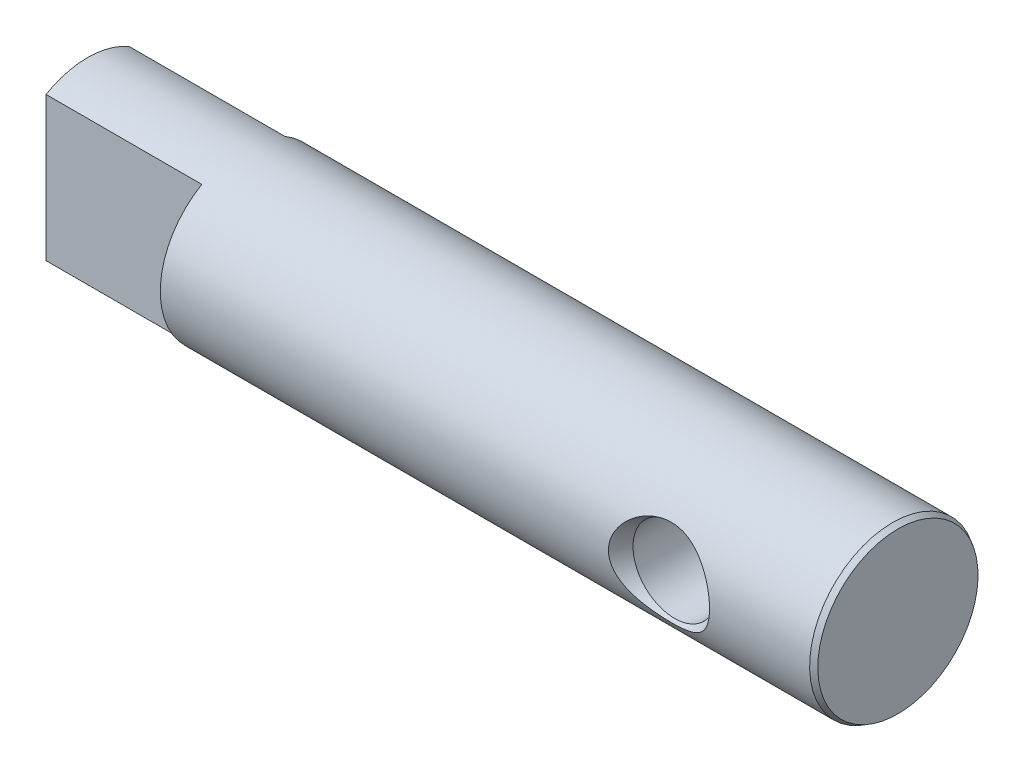
ISO-10303-21;
HEADER;
FILE_DESCRIPTION(('STEP AP214'),'2;1');
FILE_NAME('part.step','',(''),(''),'','','');
FILE_SCHEMA(('AUTOMOTIVE_DESIGN { 1 0 10303 214 1 1 1 1 }'));
ENDSEC;
DATA;
#1=APPLICATION_CONTEXT('core data for automotive mechanical design processes');
#2=APPLICATION_PROTOCOL_DEFINITION('international standard','automotive_design',2000,#1);
#3=PRODUCT_CONTEXT('',#1,'mechanical');
#4=PRODUCT('Part','Part','',(#3));
#5=PRODUCT_RELATED_PRODUCT_CATEGORY('part','',(#4));
#6=PRODUCT_DEFINITION_FORMATION('','',#4);
#7=PRODUCT_DEFINITION_CONTEXT('part definition',#1,'design');
#8=PRODUCT_DEFINITION('design','',#6,#7);
#9=PRODUCT_DEFINITION_SHAPE('','',#8);
#10=(LENGTH_UNIT() NAMED_UNIT(*) SI_UNIT(.MILLI.,.METRE.));
#11=(NAMED_UNIT(*) PLANE_ANGLE_UNIT() SI_UNIT($,.RADIAN.));
#12=(NAMED_UNIT(*) SI_UNIT($,.STERADIAN.) SOLID_ANGLE_UNIT());
#13=UNCERTAINTY_MEASURE_WITH_UNIT(LENGTH_MEASURE(1.E-05),#10,'distance_accuracy_value','');
#14=(GEOMETRIC_REPRESENTATION_CONTEXT(3) GLOBAL_UNCERTAINTY_ASSIGNED_CONTEXT((#13)) GLOBAL_UNIT_ASSIGNED_CONTEXT((#10,
#11,#12)) REPRESENTATION_CONTEXT('',''));
#15=CARTESIAN_POINT('',(0.,0.,0.));
#16=DIRECTION('',(0.,0.,1.));
#17=DIRECTION('',(1.,0.,0.));
#18=AXIS2_PLACEMENT_3D('',#15,#16,#17);
#19=CARTESIAN_POINT('',(15.,0.,0.));
#20=DIRECTION('',(1.,0.,0.));
#21=DIRECTION('',(0.,1.,0.));
#22=AXIS2_PLACEMENT_3D('',#19,#20,#21);
#23=CYLINDRICAL_SURFACE('',#22,8.);
#24=CARTESIAN_POINT('',(14.5,0.,0.));
#25=DIRECTION('',(1.,0.,0.));
#26=DIRECTION('',(0.,1.,0.));
#27=AXIS2_PLACEMENT_3D('',#24,#25,#26);
#28=CIRCLE('',#27,8.);
#29=CARTESIAN_POINT('',(14.5,8.,0.));
#30=VERTEX_POINT('',#29);
#31=EDGE_CURVE('E122',#30,#30,#28,.T.);
#32=ORIENTED_EDGE('',*,*,#31,.F.);
#33=EDGE_LOOP('',(#32));
#34=FACE_BOUND('',#33,.T.);
#35=CARTESIAN_POINT('',(-3.23683477862762,-3.12486114398773,-7.36445813134765));
#36=CARTESIAN_POINT('',(-3.04194482102559,-3.27409805570671,-7.30113503807417));
#37=CARTESIAN_POINT('',(-2.8351582818973,-3.40827516316058,-7.23886070557551));
#38=CARTESIAN_POINT('',(-2.40227006066119,-3.64578895202264,-7.12220400228846));
#39=CARTESIAN_POINT('',(-2.17615357990684,-3.74910172733321,-7.06782776566555));
#40=CARTESIAN_POINT('',(-1.8093683222357,-3.88632504679503,-6.9928308120319));
#41=CARTESIAN_POINT('',(-1.67354086803081,-3.9310159033196,-6.96772264500047));
#42=CARTESIAN_POINT('',(-1.3980024296328,-4.00973394904154,-6.92272341623511));
#43=CARTESIAN_POINT('',(-1.2582927521902,-4.04376468019901,-6.90283062198726));
#44=CARTESIAN_POINT('',(-0.975989373587526,-4.1009569763707,-6.86900691469607));
#45=CARTESIAN_POINT('',(-0.833396289113142,-4.12412084040686,-6.85507474066378));
#46=CARTESIAN_POINT('',(-0.546371553215897,-4.15942436549178,-6.83371186825516));
#47=CARTESIAN_POINT('',(-0.401940028075111,-4.17156477963922,-6.82628072574342));
#48=CARTESIAN_POINT('',(-0.11737636637319,-4.18449820507676,-6.81835967203449));
#49=CARTESIAN_POINT('',(0.0227323773659287,-4.18566790283176,-6.81763934662852));
#50=CARTESIAN_POINT('',(0.302538211509929,-4.17763213055545,-6.82256639061613));
#51=CARTESIAN_POINT('',(0.442235307127359,-4.16842679247037,-6.82821367902853));
#52=CARTESIAN_POINT('',(0.720181380135249,-4.13971054275887,-6.84566119310642));
#53=CARTESIAN_POINT('',(0.858430287005049,-4.12019913162761,-6.85746171700065));
#54=CARTESIAN_POINT('',(1.13248544326332,-4.07100815023276,-6.88677792246891));
#55=CARTESIAN_POINT('',(1.26829167404808,-4.04132850256114,-6.90429364755117));
#56=CARTESIAN_POINT('',(1.53380980792103,-3.97268572731665,-6.94401226579535));
#57=CARTESIAN_POINT('',(1.66358956475488,-3.93392523677235,-6.96611178679297));
#58=CARTESIAN_POINT('',(1.91917360136902,-3.84699715379752,-7.01449073055792));
#59=CARTESIAN_POINT('',(2.04497642400082,-3.79882615872705,-7.04077166459627));
#60=CARTESIAN_POINT('',(2.41543641148982,-3.64038084621409,-7.12474372442281));
#61=CARTESIAN_POINT('',(2.6531645010099,-3.51616919693082,-7.187567199659));
#62=CARTESIAN_POINT('',(3.11693331884269,-3.22376849079439,-7.3235775171216));
#63=CARTESIAN_POINT('',(3.34152894849119,-3.05347126626387,-7.39715149529301));
#64=CARTESIAN_POINT('',(3.75565806193333,-2.67392533395375,-7.54262523666468));
#65=CARTESIAN_POINT('',(3.94524483239767,-2.46473681276248,-7.61452739623738));
#66=CARTESIAN_POINT('',(4.23546879597314,-2.07020129349562,-7.72946817167445));
#67=CARTESIAN_POINT('',(4.34637538673362,-1.89313858079832,-7.77511559159303));
#68=CARTESIAN_POINT('',(4.53930585634451,-1.52157417839834,-7.85625469888758));
#69=CARTESIAN_POINT('',(4.62135480490873,-1.32708781052204,-7.89175519622646));
#70=CARTESIAN_POINT('',(4.71945944505806,-1.02509569463906,-7.93471574001735));
#71=CARTESIAN_POINT('',(4.7480673167741,-0.922260713203622,-7.94735243354183));
#72=CARTESIAN_POINT('',(4.79628013133841,-0.714124740015657,-7.96874767536054));
#73=CARTESIAN_POINT('',(4.81588949721979,-0.60882498658076,-7.97750812886604));
#74=CARTESIAN_POINT('',(4.84572253122964,-0.396663671065642,-7.9908666349737));
#75=CARTESIAN_POINT('',(4.85594853413815,-0.289802504224912,-7.99546572300802));
#76=CARTESIAN_POINT('',(4.86683259853382,-0.0755312418461475,-8.00036283471437));
#77=CARTESIAN_POINT('',(4.8674917117092,0.031878792056301,-8.00066133115041));
#78=CARTESIAN_POINT('',(4.85602122424879,0.327993099462743,-7.99549493147962));
#79=CARTESIAN_POINT('',(4.83377402217744,0.516336923590174,-7.98546956728481));
#80=CARTESIAN_POINT('',(4.76076056298121,0.886131794106836,-7.95294570913011));
#81=CARTESIAN_POINT('',(4.70999155251569,1.06758217323457,-7.93044601096843));
#82=CARTESIAN_POINT('',(4.58225764282035,1.4207562542547,-7.87487504930767));
#83=CARTESIAN_POINT('',(4.50510110970216,1.59239776707907,-7.84172656119261));
#84=CARTESIAN_POINT('',(4.32808955178763,1.92162934291437,-7.76761722754472));
#85=CARTESIAN_POINT('',(4.2282263555171,2.07921431888789,-7.72665357041384));
#86=CARTESIAN_POINT('',(3.99271026715514,2.40111827354969,-7.63326718076986));
#87=CARTESIAN_POINT('',(3.85393795215728,2.56291624837103,-7.58004697606915));
#88=CARTESIAN_POINT('',(3.55511818002344,2.86458749770865,-7.4712720079313));
#89=CARTESIAN_POINT('',(3.39505516716755,3.00444457704295,-7.41571555804482));
#90=CARTESIAN_POINT('',(3.02438589661278,3.28660593496309,-7.29562099131359));
#91=CARTESIAN_POINT('',(2.81000195956824,3.42410532472884,-7.23143523453749));
#92=CARTESIAN_POINT('',(2.36089753438494,3.66613638984076,-7.11180263242036));
#93=CARTESIAN_POINT('',(2.12616461325289,3.77064772631636,-7.05636118890538));
#94=CARTESIAN_POINT('',(1.74975172863505,3.90643823448512,-6.98160129282279));
#95=CARTESIAN_POINT('',(1.61323780340777,3.94959417826302,-6.95719737284959));
#96=CARTESIAN_POINT('',(1.33646312906615,4.02520250282628,-6.91372970113895));
#97=CARTESIAN_POINT('',(1.19620372202174,4.05765866334066,-6.89466406399722));
#98=CARTESIAN_POINT('',(0.912961052412127,4.11166374769409,-6.86259479613064));
#99=CARTESIAN_POINT('',(0.769978546080682,4.13321565521902,-6.84958950721465));
#100=CARTESIAN_POINT('',(0.482338949265338,4.16526857657996,-6.83014585052001));
#101=CARTESIAN_POINT('',(0.337681966498179,4.17577029730881,-6.82370706267572));
#102=CARTESIAN_POINT('',(0.0532308453931742,4.1854553724578,-6.81777033186432));
#103=CARTESIAN_POINT('',(-0.0865444764583089,4.18504440015684,-6.81802361315823));
#104=CARTESIAN_POINT('',(-0.365526054709867,4.1739031804269,-6.82484981393506));
#105=CARTESIAN_POINT('',(-0.504732319885102,4.16317309273164,-6.83142263559526));
#106=CARTESIAN_POINT('',(-0.781533231103866,4.13147587545711,-6.85063855762058));
#107=CARTESIAN_POINT('',(-0.919128034420098,4.11050975354742,-6.86328106046386));
#108=CARTESIAN_POINT('',(-1.19180132582754,4.0584760592484,-6.89417767269749));
#109=CARTESIAN_POINT('',(-1.3268788153677,4.02740456485999,-6.91243396070542));
#110=CARTESIAN_POINT('',(-1.5913273520507,3.95594594585772,-6.95357177943315));
#111=CARTESIAN_POINT('',(-1.72075626756812,3.91572521139592,-6.97636988806882));
#112=CARTESIAN_POINT('',(-1.97550483917783,3.82588160948244,-7.02604146953849));
#113=CARTESIAN_POINT('',(-2.10082298429147,3.77625532931064,-7.05291642091057));
#114=CARTESIAN_POINT('',(-2.46971690809438,3.61340141794667,-7.13851717151235));
#115=CARTESIAN_POINT('',(-2.70624754924898,3.48619457571089,-7.20222141042587));
#116=CARTESIAN_POINT('',(-3.0483374308618,3.26447575830548,-7.304127958235));
#117=CARTESIAN_POINT('',(-3.16310278214844,3.18279294504722,-7.34020599824843));
#118=CARTESIAN_POINT('',(-3.38472542068525,3.00955356491502,-7.41292399863441));
#119=CARTESIAN_POINT('',(-3.49158228888106,2.91799647545412,-7.44956398865951));
#120=CARTESIAN_POINT('',(-3.79845940467568,2.62891359806605,-7.55850676997163));
#121=CARTESIAN_POINT('',(-3.98541478626391,2.41657455380378,-7.63002844085584));
#122=CARTESIAN_POINT('',(-4.26902497843416,2.01847457702593,-7.74314551913165));
#123=CARTESIAN_POINT('',(-4.37642318326839,1.84108822889373,-7.78760003050093));
#124=CARTESIAN_POINT('',(-4.56238100511637,1.46945331026278,-7.86616357873329));
#125=CARTESIAN_POINT('',(-4.64096619504553,1.27521988263817,-7.90028178486115));
#126=CARTESIAN_POINT('',(-4.73399684601157,0.97415429784612,-7.94112555628845));
#127=CARTESIAN_POINT('',(-4.76092481314732,0.871737230392553,-7.95304537459452));
#128=CARTESIAN_POINT('',(-4.80586360721695,0.664612699691875,-7.9730222166424));
#129=CARTESIAN_POINT('',(-4.82387874044648,0.559906368103363,-7.98108110575846));
#130=CARTESIAN_POINT('',(-4.85064141039504,0.349097920956594,-7.99307650060444));
#131=CARTESIAN_POINT('',(-4.85939077907119,0.242996085508294,-7.99701382121804));
#132=CARTESIAN_POINT('',(-4.86747003651184,0.0303964000684682,-8.00065027525213));
#133=CARTESIAN_POINT('',(-4.86680087964489,-0.0761014087062501,-8.00034983807982));
#134=CARTESIAN_POINT('',(-4.85185304190732,-0.370524203194623,-7.99362076069666));
#135=CARTESIAN_POINT('',(-4.82748221662362,-0.557942779495837,-7.98264723025393));
#136=CARTESIAN_POINT('',(-4.75056600992852,-0.925580075614677,-7.94842806217762));
#137=CARTESIAN_POINT('',(-4.69801708182432,-1.10579788602472,-7.92518087970215));
#138=CARTESIAN_POINT('',(-4.56667038182692,-1.45746176768789,-7.86816285535561));
#139=CARTESIAN_POINT('',(-4.48751737905018,-1.62875079993361,-7.8342500170354));
#140=CARTESIAN_POINT('',(-4.30661525240624,-1.95702143671862,-7.75876885375977));
#141=CARTESIAN_POINT('',(-4.20485896516513,-2.11399848324676,-7.71719810259311));
#142=CARTESIAN_POINT('',(-3.9713815883863,-2.42638423714692,-7.62506864338802));
#143=CARTESIAN_POINT('',(-3.83772148964329,-2.58019515388552,-7.5740301907363));
#144=CARTESIAN_POINT('',(-3.55103770686585,-2.8677310083996,-7.46990880692985));
#145=CARTESIAN_POINT('',(-3.39800422150538,-3.00144570373369,-7.41682485044266));
#146=CARTESIAN_POINT('',(-3.23683477862762,-3.12486114398773,-7.36445813134765));
#147=B_SPLINE_CURVE_WITH_KNOTS('',3,(#35,#36,#37,#38,#39,#40,#41,#42,#43,#44,#45,#46,#47,#48,
#49,#50,#51,#52,#53,#54,#55,#56,#57,#58,#59,#60,#61,#62,#63,#64,#65,#66,#67,#68,#69,#70,#71,#72,
#73,#74,#75,#76,#77,#78,#79,#80,#81,#82,#83,#84,#85,#86,#87,#88,#89,#90,#91,#92,#93,#94,#95,#96,
#97,#98,#99,#100,#101,#102,#103,#104,#105,#106,#107,#108,#109,#110,#111,#112,#113,#114,#115,
#116,#117,#118,#119,#120,#121,#122,#123,#124,#125,#126,#127,#128,#129,#130,#131,#132,#133,#134,
#135,#136,#137,#138,#139,#140,#141,#142,#143,#144,#145,#146),.UNSPECIFIED.,.T.,.F.,(4,2,2,2,2,2,
2,2,2,2,2,2,2,2,2,2,2,2,2,2,2,2,2,2,2,2,2,2,2,2,2,2,2,2,2,2,2,2,2,2,2,2,2,2,2,2,2,2,2,2,2,2,2,2,
2,4),(0.,0.759930748320609,1.52044858713984,1.95552094753949,2.39044859599153,2.82528418850667,
3.2600900717414,3.67990958217525,4.09972375354621,4.51955827393423,4.93939599047995,
5.35063291885485,5.76201881796613,6.58473047306523,7.45447527547012,8.32288513411032,
8.96204637818385,9.6006509794263,9.92271036356119,10.2446112759243,10.5664320707654,
10.888217487577,11.4549675574443,12.0217723476922,12.592784067086,13.1640016033004,
13.8206963694026,14.4778736022957,15.2627457736361,16.0481009189707,16.4833529837587,
16.9184511293441,17.3534301563405,17.7883813555488,18.2071869275382,18.6259860167719,
19.0447438863266,19.4636644744562,19.8755020040806,20.2874892524317,21.1114158970856,
21.5471903540158,21.9829878852359,22.8522998322324,23.4861966541607,24.1195294928511,
24.4388400365716,24.7579961522226,25.077089154945,25.3961498245665,25.961129552993,
26.5261804104116,27.0990974413257,27.6721962993135,28.3003222192754,28.928767198378),.UNSPECIFIED.);
#148=CARTESIAN_POINT('',(-3.23683477862762,-3.12486114398773,-7.36445813134765));
#149=VERTEX_POINT('',#148);
#150=EDGE_CURVE('E128',#149,#149,#147,.T.);
#151=ORIENTED_EDGE('',*,*,#150,.T.);
#152=EDGE_LOOP('',(#151));
#153=FACE_BOUND('',#152,.T.);
#154=CARTESIAN_POINT('',(-3.23683477862762,-3.12486114398773,7.36445813134765));
#155=CARTESIAN_POINT('',(-3.43250380001912,-2.97502826392298,7.42803522819752));
#156=CARTESIAN_POINT('',(-3.6162093334724,-2.81001079780032,7.4926775253422));
#157=CARTESIAN_POINT('',(-3.95387321843548,-2.45060632332743,7.61777938116518));
#158=CARTESIAN_POINT('',(-4.10787330798492,-2.25626121716206,7.67824473085074));
#159=CARTESIAN_POINT('',(-4.35410362953859,-1.87895095927465,7.77819629764174));
#160=CARTESIAN_POINT('',(-4.45248669315845,-1.70048357725795,7.8194953056205));
#161=CARTESIAN_POINT('',(-4.62038752815979,-1.32820568456052,7.8912348371313));
#162=CARTESIAN_POINT('',(-4.68992369115744,-1.13440504389513,7.92168227743355));
#163=CARTESIAN_POINT('',(-4.76964890915832,-0.835398295745581,7.95690665245173));
#164=CARTESIAN_POINT('',(-4.79216454713992,-0.73395501597151,7.9669243892977));
#165=CARTESIAN_POINT('',(-4.82847818174893,-0.529235192409157,7.98313362074807));
#166=CARTESIAN_POINT('',(-4.84228017624994,-0.425959511731423,7.9893268700225));
#167=CARTESIAN_POINT('',(-4.86090063218761,-0.218448992539,7.99769091606255));
#168=CARTESIAN_POINT('',(-4.86572020146229,-0.11421427390003,7.99986220887175));
#169=CARTESIAN_POINT('',(-4.86630294612177,0.0942531321322212,8.00012533952247));
#170=CARTESIAN_POINT('',(-4.86206685894727,0.198485818999725,7.99821750954435));
#171=CARTESIAN_POINT('',(-4.83762367991929,0.488630039146232,7.98723062282365));
#172=CARTESIAN_POINT('',(-4.8074008875875,0.673634379173473,7.97365800012915));
#173=CARTESIAN_POINT('',(-4.71967682584846,1.03560424003672,7.93478326183723));
#174=CARTESIAN_POINT('',(-4.6621712847674,1.2125684972769,7.90947930947374));
#175=CARTESIAN_POINT('',(-4.52060759463509,1.56022903105216,7.84842740870813));
#176=CARTESIAN_POINT('',(-4.43576887433181,1.73055134308942,7.81237510988791));
#177=CARTESIAN_POINT('',(-4.24375626651079,2.05618174149088,7.73306321132664));
#178=CARTESIAN_POINT('',(-4.13657326435784,2.21148366280296,7.68980067184722));
#179=CARTESIAN_POINT('',(-3.8842866545634,2.52952111155766,7.59167495410644));
#180=CARTESIAN_POINT('',(-3.73585236350026,2.68937898238197,7.5360682021022));
#181=CARTESIAN_POINT('',(-3.41776619021725,2.98586910932477,7.42359620501281));
#182=CARTESIAN_POINT('',(-3.24809782344291,3.12248312408329,7.36673001073054));
#183=CARTESIAN_POINT('',(-2.85708630737078,3.39570653392885,7.24538431778572));
#184=CARTESIAN_POINT('',(-2.63206173670881,3.52733604029798,7.1815239135658));
#185=CARTESIAN_POINT('',(-2.16217912828194,3.7558691842102,7.06470091026159));
#186=CARTESIAN_POINT('',(-1.9173120132294,3.85275681732341,7.01174333852234));
#187=CARTESIAN_POINT('',(-1.52863330035226,3.97438419873328,6.94310005594272));
#188=CARTESIAN_POINT('',(-1.38972616392214,4.01186777306666,6.92143640228953));
#189=CARTESIAN_POINT('',(-1.10868168235477,4.07598155319635,6.88387754819334));
#190=CARTESIAN_POINT('',(-0.966545554840216,4.10261578074466,6.86798021047044));
#191=CARTESIAN_POINT('',(-0.680122468482526,4.14484601834136,6.84257681224946));
#192=CARTESIAN_POINT('',(-0.535836116302697,4.16044508381896,6.83306898265303));
#193=CARTESIAN_POINT('',(-0.246207335311223,4.18049632558497,6.82082044157386));
#194=CARTESIAN_POINT('',(-0.100864973001008,4.18494919779804,6.81807930760528));
#195=CARTESIAN_POINT('',(0.182903975851541,4.18272526123302,6.81944335869363));
#196=CARTESIAN_POINT('',(0.321336444696048,4.17655867218818,6.82323469120608));
#197=CARTESIAN_POINT('',(0.597068525956987,4.15411243270612,6.83692339514577));
#198=CARTESIAN_POINT('',(0.734368163949969,4.13783301122852,6.84682062833231));
#199=CARTESIAN_POINT('',(1.00686803106547,4.09527264209758,6.87236197491127));
#200=CARTESIAN_POINT('',(1.1420682852245,4.06899181381302,6.88800601971428));
#201=CARTESIAN_POINT('',(1.40948217316336,4.00659508756039,6.92448456635847));
#202=CARTESIAN_POINT('',(1.54169461962047,3.97047535163803,6.94532109340889));
#203=CARTESIAN_POINT('',(1.93196430452126,3.84780271562933,7.01450770409599));
#204=CARTESIAN_POINT('',(2.18447149720092,3.74680827147029,7.06961809890549));
#205=CARTESIAN_POINT('',(2.66838025623532,3.50765833626671,7.19126245144119));
#206=CARTESIAN_POINT('',(2.8997606475611,3.369466098358,7.25780768174977));
#207=CARTESIAN_POINT('',(3.34698675468196,3.04871196437968,7.39849046659531));
#208=CARTESIAN_POINT('',(3.56138105907463,2.8642029796647,7.47284317382024));
#209=CARTESIAN_POINT('',(3.9516267880919,2.45657833488806,7.61653346721242));
#210=CARTESIAN_POINT('',(4.12755602038676,2.23354227596872,7.68588098385881));
#211=CARTESIAN_POINT('',(4.38592134382589,1.82326704300953,7.79144174549593));
#212=CARTESIAN_POINT('',(4.48064697716421,1.64469272401387,7.83140944888816));
#213=CARTESIAN_POINT('',(4.64130312013421,1.27288527164847,7.90033359050421));
#214=CARTESIAN_POINT('',(4.70726047646347,1.07966600356353,7.92930029163927));
#215=CARTESIAN_POINT('',(4.78182439308175,0.78208967464549,7.96231601770833));
#216=CARTESIAN_POINT('',(4.80264730510341,0.681231069214919,7.97159648398902));
#217=CARTESIAN_POINT('',(4.83568769097189,0.477855783627333,7.98636446639487));
#218=CARTESIAN_POINT('',(4.84790905587083,0.375339874676613,7.99185369752695));
#219=CARTESIAN_POINT('',(4.86351271791034,0.169501034349769,7.99886699894835));
#220=CARTESIAN_POINT('',(4.86689510545155,0.0661781112382212,8.00039110979094));
#221=CARTESIAN_POINT('',(4.86477403036453,-0.140326547060231,7.99943707697414));
#222=CARTESIAN_POINT('',(4.8592712035167,-0.243508291820395,7.99695921967508));
#223=CARTESIAN_POINT('',(4.83142779029,-0.531895247294727,7.98445218102808));
#224=CARTESIAN_POINT('',(4.79907810084214,-0.716045963429003,7.96994066636602));
#225=CARTESIAN_POINT('',(4.70741330897236,-1.07601043900812,7.92938428454408));
#226=CARTESIAN_POINT('',(4.64809381313773,-1.2518228349759,7.90333753829952));
#227=CARTESIAN_POINT('',(4.50273095524738,-1.59807253325068,7.84080866128867));
#228=CARTESIAN_POINT('',(4.4157573073297,-1.76805134083414,7.80396743134722));
#229=CARTESIAN_POINT('',(4.21956182254262,-2.09272696347914,7.72324709475712));
#230=CARTESIAN_POINT('',(4.11033060426357,-2.24741729359117,7.67936502210615));
#231=CARTESIAN_POINT('',(3.85335117588885,-2.56435563759993,7.57997586142319));
#232=CARTESIAN_POINT('',(3.7022209110615,-2.7236290608226,7.52374600462414));
#233=CARTESIAN_POINT('',(3.37875726970878,-3.01858254486592,7.41034271723461));
#234=CARTESIAN_POINT('',(3.20640718387118,-3.15424380704457,7.35316857414626));
#235=CARTESIAN_POINT('',(2.80981168760849,-3.42480537610005,7.23164455790214));
#236=CARTESIAN_POINT('',(2.58192130321122,-3.55468963693595,7.16798808143958));
#237=CARTESIAN_POINT('',(2.10647410589024,-3.77925153659704,7.0521844538938));
#238=CARTESIAN_POINT('',(1.85890903511433,-3.87391429654281,7.00004217060884));
#239=CARTESIAN_POINT('',(1.46711081637439,-3.99147140245171,6.93327855876442));
#240=CARTESIAN_POINT('',(1.32769336790125,-4.02735305358203,6.9124278451041));
#241=CARTESIAN_POINT('',(1.04571992833655,-4.08825173844331,6.87658803214365));
#242=CARTESIAN_POINT('',(0.903163778675559,-4.11326822192883,6.86159922971251));
#243=CARTESIAN_POINT('',(0.616104119437916,-4.15223107025716,6.8380913307595));
#244=CARTESIAN_POINT('',(0.471601737240923,-4.1661835853848,6.82956863994262));
#245=CARTESIAN_POINT('',(0.181713877814429,-4.18293264133514,6.81932355821861));
#246=CARTESIAN_POINT('',(0.0363284537892217,-4.18572984772955,6.81760076160183));
#247=CARTESIAN_POINT('',(-0.247056908926679,-4.18028225706717,6.82094175056314));
#248=CARTESIAN_POINT('',(-0.385071351224055,-4.17256914365655,6.8256787638732));
#249=CARTESIAN_POINT('',(-0.659819015538331,-4.14708879956016,6.84118963052634));
#250=CARTESIAN_POINT('',(-0.796552276573367,-4.12932187607963,6.85196329941267));
#251=CARTESIAN_POINT('',(-1.06784018207287,-4.08384452166614,6.87916548609465));
#252=CARTESIAN_POINT('',(-1.2023940062975,-4.05613043396346,6.89559608339581));
#253=CARTESIAN_POINT('',(-1.46840025381823,-3.99092986326145,6.93353333830635));
#254=CARTESIAN_POINT('',(-1.59985136076472,-3.95343931099969,6.95504210925276));
#255=CARTESIAN_POINT('',(-2.00260653255834,-3.8218825689745,7.02878414938699));
#256=CARTESIAN_POINT('',(-2.26731743408594,-3.71118657260432,7.0886353215497));
#257=CARTESIAN_POINT('',(-2.77221349274683,-3.44861171937134,7.22000851288043));
#258=CARTESIAN_POINT('',(-3.01239433805483,-3.2967256393221,7.29153257815663));
#259=CARTESIAN_POINT('',(-3.23683477862762,-3.12486114398773,7.36445813134765));
#260=B_SPLINE_CURVE_WITH_KNOTS('',3,(#154,#155,#156,#157,#158,#159,#160,#161,#162,#163,#164,
#165,#166,#167,#168,#169,#170,#171,#172,#173,#174,#175,#176,#177,#178,#179,#180,#181,#182,#183,
#184,#185,#186,#187,#188,#189,#190,#191,#192,#193,#194,#195,#196,#197,#198,#199,#200,#201,#202,
#203,#204,#205,#206,#207,#208,#209,#210,#211,#212,#213,#214,#215,#216,#217,#218,#219,#220,#221,
#222,#223,#224,#225,#226,#227,#228,#229,#230,#231,#232,#233,#234,#235,#236,#237,#238,#239,#240,
#241,#242,#243,#244,#245,#246,#247,#248,#249,#250,#251,#252,#253,#254,#255,#256,#257,#258,#259),
.UNSPECIFIED.,.T.,.F.,(4,2,2,2,2,2,2,2,2,2,2,2,2,2,2,2,2,2,2,2,2,2,2,2,2,2,2,2,2,2,2,2,2,2,2,2,
2,2,2,2,2,2,2,2,2,2,2,2,2,2,2,2,4),(0.,0.76274494925848,1.52441025957168,2.14577811210463,
2.76674919453839,3.07955301312156,3.39221321087853,3.70483484446485,4.01743102090902,
4.57840798828686,5.13947281711358,5.71824114129725,6.29724601910232,6.97013277573442,
7.64354519014662,8.44551730455413,9.24785838775256,9.6838790602745,10.1197379565784,
10.5554761244522,10.9911870858627,11.4065432342599,11.8218899791275,12.2372317669052,
12.6527358035077,13.481278488349,14.3106426950297,15.1835089218807,16.0545928234825,
16.670394814513,17.2856209001013,17.5954611656285,17.9051611795425,18.2148580259877,
18.5245327130962,19.0842995038894,19.6441575140315,20.2253011243305,20.8066901911523,
21.4841442201307,22.162135156133,22.9686081704458,23.7754214833641,24.2113367366396,
24.6472740634279,25.0829688893486,25.5186377195306,25.9330663303579,26.3474822785467,
26.7620507303454,27.1767920143573,28.0515384441514,28.9264383707663),.UNSPECIFIED.);
#261=CARTESIAN_POINT('',(-3.23683477862762,-3.12486114398773,7.36445813134765));
#262=VERTEX_POINT('',#261);
#263=EDGE_CURVE('E135',#262,#262,#260,.T.);
#264=ORIENTED_EDGE('',*,*,#263,.T.);
#265=EDGE_LOOP('',(#264));
#266=FACE_BOUND('',#265,.T.);
#267=CARTESIAN_POINT('',(-48.,0.,0.));
#268=DIRECTION('',(-1.,0.,0.));
#269=DIRECTION('',(0.,-1.,0.));
#270=AXIS2_PLACEMENT_3D('',#267,#268,#269);
#271=CIRCLE('',#270,8.);
#272=CARTESIAN_POINT('',(-48.,-6.92820323027552,-4.));
#273=VERTEX_POINT('',#272);
#274=CARTESIAN_POINT('',(-48.,6.9282032302755,-4.));
#275=VERTEX_POINT('',#274);
#276=EDGE_CURVE('E12',#273,#275,#271,.F.);
#277=ORIENTED_EDGE('',*,*,#276,.T.);
#278=DIRECTION('',(1.,0.,0.));
#279=VECTOR('',#278,1.);
#280=CARTESIAN_POINT('',(15.,6.92820323027551,-4.));
#281=LINE('',#280,#279);
#282=CARTESIAN_POINT('',(-63.,6.9282032302755,-4.));
#283=VERTEX_POINT('',#282);
#284=EDGE_CURVE('E109',#275,#283,#281,.F.);
#285=ORIENTED_EDGE('',*,*,#284,.T.);
#286=CARTESIAN_POINT('',(-63.,0.,0.));
#287=DIRECTION('',(1.,0.,0.));
#288=DIRECTION('',(0.,1.,0.));
#289=AXIS2_PLACEMENT_3D('',#286,#287,#288);
#290=CIRCLE('',#289,8.);
#291=CARTESIAN_POINT('',(-63.,6.9282032302755,4.));
#292=VERTEX_POINT('',#291);
#293=EDGE_CURVE('E118',#283,#292,#290,.T.);
#294=ORIENTED_EDGE('',*,*,#293,.T.);
#295=DIRECTION('',(1.,0.,0.));
#296=VECTOR('',#295,1.);
#297=CARTESIAN_POINT('',(15.,6.92820323027551,4.));
#298=LINE('',#297,#296);
#299=CARTESIAN_POINT('',(-48.,6.9282032302755,4.));
#300=VERTEX_POINT('',#299);
#301=EDGE_CURVE('E64',#292,#300,#298,.T.);
#302=ORIENTED_EDGE('',*,*,#301,.T.);
#303=CARTESIAN_POINT('',(-48.,-6.92820323027551,4.));
#304=VERTEX_POINT('',#303);
#305=EDGE_CURVE('E45',#300,#304,#271,.F.);
#306=ORIENTED_EDGE('',*,*,#305,.T.);
#307=DIRECTION('',(1.,0.,0.));
#308=VECTOR('',#307,1.);
#309=CARTESIAN_POINT('',(15.,-6.92820323027551,4.));
#310=LINE('',#309,#308);
#311=CARTESIAN_POINT('',(-63.,-6.92820323027552,4.));
#312=VERTEX_POINT('',#311);
#313=EDGE_CURVE('E105',#304,#312,#310,.F.);
#314=ORIENTED_EDGE('',*,*,#313,.T.);
#315=CARTESIAN_POINT('',(-63.,-6.92820323027552,-4.));
#316=VERTEX_POINT('',#315);
#317=EDGE_CURVE('E121',#312,#316,#290,.T.);
#318=ORIENTED_EDGE('',*,*,#317,.T.);
#319=DIRECTION('',(1.,0.,0.));
#320=VECTOR('',#319,1.);
#321=CARTESIAN_POINT('',(15.,-6.92820323027551,-4.));
#322=LINE('',#321,#320);
#323=EDGE_CURVE('E56',#316,#273,#322,.T.);
#324=ORIENTED_EDGE('',*,*,#323,.T.);
#325=EDGE_LOOP('',(#277,#285,#294,#302,#306,#314,#318,#324));
#326=FACE_BOUND('',#325,.T.);
#327=ADVANCED_FACE('F41',(#34,#153,#266,#326),#23,.T.);
#328=CARTESIAN_POINT('',(-63.,0.,0.));
#329=DIRECTION('',(-1.,0.,0.));
#330=DIRECTION('',(0.,-1.,0.));
#331=AXIS2_PLACEMENT_3D('',#328,#329,#330);
#332=PLANE('',#331);
#333=CARTESIAN_POINT('',(-63.,0.,0.));
#334=DIRECTION('',(-1.,0.,0.));
#335=DIRECTION('',(0.,0.,1.));
#336=AXIS2_PLACEMENT_3D('',#333,#334,#335);
#337=CIRCLE('',#336,1.25);
#338=CARTESIAN_POINT('',(-63.,0.,1.25));
#339=VERTEX_POINT('',#338);
#340=EDGE_CURVE('E96',#339,#339,#337,.T.);
#341=ORIENTED_EDGE('',*,*,#340,.F.);
#342=EDGE_LOOP('',(#341));
#343=FACE_BOUND('',#342,.T.);
#344=ORIENTED_EDGE('',*,*,#293,.F.);
#345=DIRECTION('',(0.,-1.,0.));
#346=VECTOR('',#345,1.);
#347=CARTESIAN_POINT('',(-63.,0.,-4.));
#348=LINE('',#347,#346);
#349=EDGE_CURVE('E183',#283,#316,#348,.T.);
#350=ORIENTED_EDGE('',*,*,#349,.T.);
#351=ORIENTED_EDGE('',*,*,#317,.F.);
#352=DIRECTION('',(0.,1.,0.));
#353=VECTOR('',#352,1.);
#354=CARTESIAN_POINT('',(-63.,0.,4.));
#355=LINE('',#354,#353);
#356=EDGE_CURVE('E186',#312,#292,#355,.T.);
#357=ORIENTED_EDGE('',*,*,#356,.T.);
#358=EDGE_LOOP('',(#344,#350,#351,#357));
#359=FACE_BOUND('',#358,.T.);
#360=ADVANCED_FACE('F43',(#343,#359),#332,.T.);
#361=CARTESIAN_POINT('',(15.,0.,0.));
#362=DIRECTION('',(-1.,0.,0.));
#363=DIRECTION('',(0.,-1.,0.));
#364=AXIS2_PLACEMENT_3D('',#361,#362,#363);
#365=PLANE('',#364);
#366=CARTESIAN_POINT('',(15.,0.,0.));
#367=DIRECTION('',(1.,0.,0.));
#368=DIRECTION('',(0.,1.,0.));
#369=AXIS2_PLACEMENT_3D('',#366,#367,#368);
#370=CIRCLE('',#369,7.71132486540519);
#371=CARTESIAN_POINT('',(15.,7.71132486540519,0.));
#372=VERTEX_POINT('',#371);
#373=EDGE_CURVE('E125',#372,#372,#370,.T.);
#374=ORIENTED_EDGE('',*,*,#373,.T.);
#375=EDGE_LOOP('',(#374));
#376=FACE_BOUND('',#375,.T.);
#377=ADVANCED_FACE('F162',(#376),#365,.F.);
#378=CARTESIAN_POINT('',(14.5,0.,0.));
#379=DIRECTION('',(-1.,0.,0.));
#380=DIRECTION('',(0.,-1.,0.));
#381=AXIS2_PLACEMENT_3D('',#378,#379,#380);
#382=CONICAL_SURFACE('',#381,8.,0.523598775598291);
#383=ORIENTED_EDGE('',*,*,#373,.F.);
#384=EDGE_LOOP('',(#383));
#385=FACE_BOUND('',#384,.T.);
#386=ORIENTED_EDGE('',*,*,#31,.T.);
#387=EDGE_LOOP('',(#386));
#388=FACE_BOUND('',#387,.T.);
#389=ADVANCED_FACE('F157',(#385,#388),#382,.T.);
#390=CARTESIAN_POINT('',(0.,0.,8.));
#391=DIRECTION('',(0.,0.,1.));
#392=DIRECTION('',(1.,0.,0.));
#393=AXIS2_PLACEMENT_3D('',#390,#391,#392);
#394=CYLINDRICAL_SURFACE('',#393,4.);
#395=CARTESIAN_POINT('',(0.,0.,6.5));
#396=DIRECTION('',(0.,0.,1.));
#397=DIRECTION('',(1.,0.,0.));
#398=AXIS2_PLACEMENT_3D('',#395,#396,#397);
#399=CIRCLE('',#398,4.);
#400=CARTESIAN_POINT('',(4.,0.,6.5));
#401=VERTEX_POINT('',#400);
#402=EDGE_CURVE('E115',#401,#401,#399,.T.);
#403=ORIENTED_EDGE('',*,*,#402,.T.);
#404=EDGE_LOOP('',(#403));
#405=FACE_BOUND('',#404,.T.);
#406=CARTESIAN_POINT('',(0.,0.,-6.5));
#407=DIRECTION('',(0.,0.,1.));
#408=DIRECTION('',(1.,0.,0.));
#409=AXIS2_PLACEMENT_3D('',#406,#407,#408);
#410=CIRCLE('',#409,4.);
#411=CARTESIAN_POINT('',(4.,0.,-6.5));
#412=VERTEX_POINT('',#411);
#413=EDGE_CURVE('E112',#412,#412,#410,.T.);
#414=ORIENTED_EDGE('',*,*,#413,.F.);
#415=EDGE_LOOP('',(#414));
#416=FACE_BOUND('',#415,.T.);
#417=ADVANCED_FACE('F154',(#405,#416),#394,.F.);
#418=CARTESIAN_POINT('',(0.,0.,6.5));
#419=DIRECTION('',(0.,0.,1.));
#420=DIRECTION('',(1.,0.,0.));
#421=AXIS2_PLACEMENT_3D('',#418,#419,#420);
#422=CONICAL_SURFACE('',#421,4.,0.523598775598297);
#423=ORIENTED_EDGE('',*,*,#263,.F.);
#424=EDGE_LOOP('',(#423));
#425=FACE_BOUND('',#424,.T.);
#426=ORIENTED_EDGE('',*,*,#402,.F.);
#427=EDGE_LOOP('',(#426));
#428=FACE_BOUND('',#427,.T.);
#429=ADVANCED_FACE('F148',(#425,#428),#422,.F.);
#430=CARTESIAN_POINT('',(0.,0.,-8.));
#431=DIRECTION('',(0.,0.,-1.));
#432=DIRECTION('',(-1.,0.,0.));
#433=AXIS2_PLACEMENT_3D('',#430,#431,#432);
#434=CONICAL_SURFACE('',#433,4.86602540378444,0.5235987755983);
#435=ORIENTED_EDGE('',*,*,#413,.T.);
#436=EDGE_LOOP('',(#435));
#437=FACE_BOUND('',#436,.T.);
#438=ORIENTED_EDGE('',*,*,#150,.F.);
#439=EDGE_LOOP('',(#438));
#440=FACE_BOUND('',#439,.T.);
#441=ADVANCED_FACE('F143',(#437,#440),#434,.F.);
#442=CARTESIAN_POINT('',(-48.,9.99999999999999,4.));
#443=DIRECTION('',(0.,0.,1.));
#444=DIRECTION('',(0.,-1.,0.));
#445=AXIS2_PLACEMENT_3D('',#442,#443,#444);
#446=PLANE('',#445);
#447=DIRECTION('',(0.,1.,0.));
#448=VECTOR('',#447,1.);
#449=CARTESIAN_POINT('',(-48.,9.99999999999999,4.));
#450=LINE('',#449,#448);
#451=EDGE_CURVE('E98',#304,#300,#450,.T.);
#452=ORIENTED_EDGE('',*,*,#451,.T.);
#453=ORIENTED_EDGE('',*,*,#301,.F.);
#454=ORIENTED_EDGE('',*,*,#356,.F.);
#455=ORIENTED_EDGE('',*,*,#313,.F.);
#456=EDGE_LOOP('',(#452,#453,#454,#455));
#457=FACE_BOUND('',#456,.T.);
#458=ADVANCED_FACE('F147',(#457),#446,.T.);
#459=CARTESIAN_POINT('',(-48.,0.,0.));
#460=DIRECTION('',(-1.,0.,0.));
#461=DIRECTION('',(0.,-1.,0.));
#462=AXIS2_PLACEMENT_3D('',#459,#460,#461);
#463=PLANE('',#462);
#464=ORIENTED_EDGE('',*,*,#451,.F.);
#465=ORIENTED_EDGE('',*,*,#305,.F.);
#466=EDGE_LOOP('',(#464,#465));
#467=FACE_BOUND('',#466,.T.);
#468=ADVANCED_FACE('F150',(#467),#463,.T.);
#469=DIRECTION('',(0.,-1.,0.));
#470=VECTOR('',#469,1.);
#471=CARTESIAN_POINT('',(-48.,9.99999999999999,-4.));
#472=LINE('',#471,#470);
#473=EDGE_CURVE('E95',#275,#273,#472,.T.);
#474=ORIENTED_EDGE('',*,*,#473,.F.);
#475=ORIENTED_EDGE('',*,*,#276,.F.);
#476=EDGE_LOOP('',(#474,#475));
#477=FACE_BOUND('',#476,.T.);
#478=ADVANCED_FACE('F182',(#477),#463,.T.);
#479=CARTESIAN_POINT('',(-48.,9.99999999999999,-4.));
#480=DIRECTION('',(0.,0.,-1.));
#481=DIRECTION('',(0.,1.,0.));
#482=AXIS2_PLACEMENT_3D('',#479,#480,#481);
#483=PLANE('',#482);
#484=ORIENTED_EDGE('',*,*,#473,.T.);
#485=ORIENTED_EDGE('',*,*,#323,.F.);
#486=ORIENTED_EDGE('',*,*,#349,.F.);
#487=ORIENTED_EDGE('',*,*,#284,.F.);
#488=EDGE_LOOP('',(#484,#485,#486,#487));
#489=FACE_BOUND('',#488,.T.);
#490=ADVANCED_FACE('F89',(#489),#483,.T.);
#491=CARTESIAN_POINT('',(-54.5,0.,0.));
#492=DIRECTION('',(-1.,0.,0.));
#493=DIRECTION('',(0.,0.,1.));
#494=AXIS2_PLACEMENT_3D('',#491,#492,#493);
#495=CONICAL_SURFACE('',#494,1.25,1.02974425867665);
#496=CARTESIAN_POINT('',(-53.7489242262155,0.,0.));
#497=VERTEX_POINT('',#496);
#498=VERTEX_LOOP('',#497);
#499=FACE_BOUND('',#498,.T.);
#500=CARTESIAN_POINT('',(-54.5,0.,0.));
#501=DIRECTION('',(-1.,0.,0.));
#502=DIRECTION('',(0.,0.,1.));
#503=AXIS2_PLACEMENT_3D('',#500,#501,#502);
#504=CIRCLE('',#503,1.25);
#505=CARTESIAN_POINT('',(-54.5,0.,1.25));
#506=VERTEX_POINT('',#505);
#507=EDGE_CURVE('E93',#506,#506,#504,.T.);
#508=ORIENTED_EDGE('',*,*,#507,.T.);
#509=EDGE_LOOP('',(#508));
#510=FACE_BOUND('',#509,.T.);
#511=ADVANCED_FACE('F85',(#499,#510),#495,.F.);
#512=CARTESIAN_POINT('',(-63.,0.,0.));
#513=DIRECTION('',(-1.,0.,0.));
#514=DIRECTION('',(0.,0.,1.));
#515=AXIS2_PLACEMENT_3D('',#512,#513,#514);
#516=CYLINDRICAL_SURFACE('',#515,1.25);
#517=ORIENTED_EDGE('',*,*,#507,.F.);
#518=EDGE_LOOP('',(#517));
#519=FACE_BOUND('',#518,.T.);
#520=ORIENTED_EDGE('',*,*,#340,.T.);
#521=EDGE_LOOP('',(#520));
#522=FACE_BOUND('',#521,.T.);
#523=ADVANCED_FACE('F88',(#519,#522),#516,.F.);
#524=CLOSED_SHELL('',(#327,#360,#377,#389,#417,#429,#441,#458,#468,#478,#490,#511,#523));
#525=MANIFOLD_SOLID_BREP('B2',#524);
#526=ADVANCED_BREP_SHAPE_REPRESENTATION('',(#18,#525),#14);
#527=SHAPE_DEFINITION_REPRESENTATION(#9,#526);
ENDSEC;
END-ISO-10303-21;
